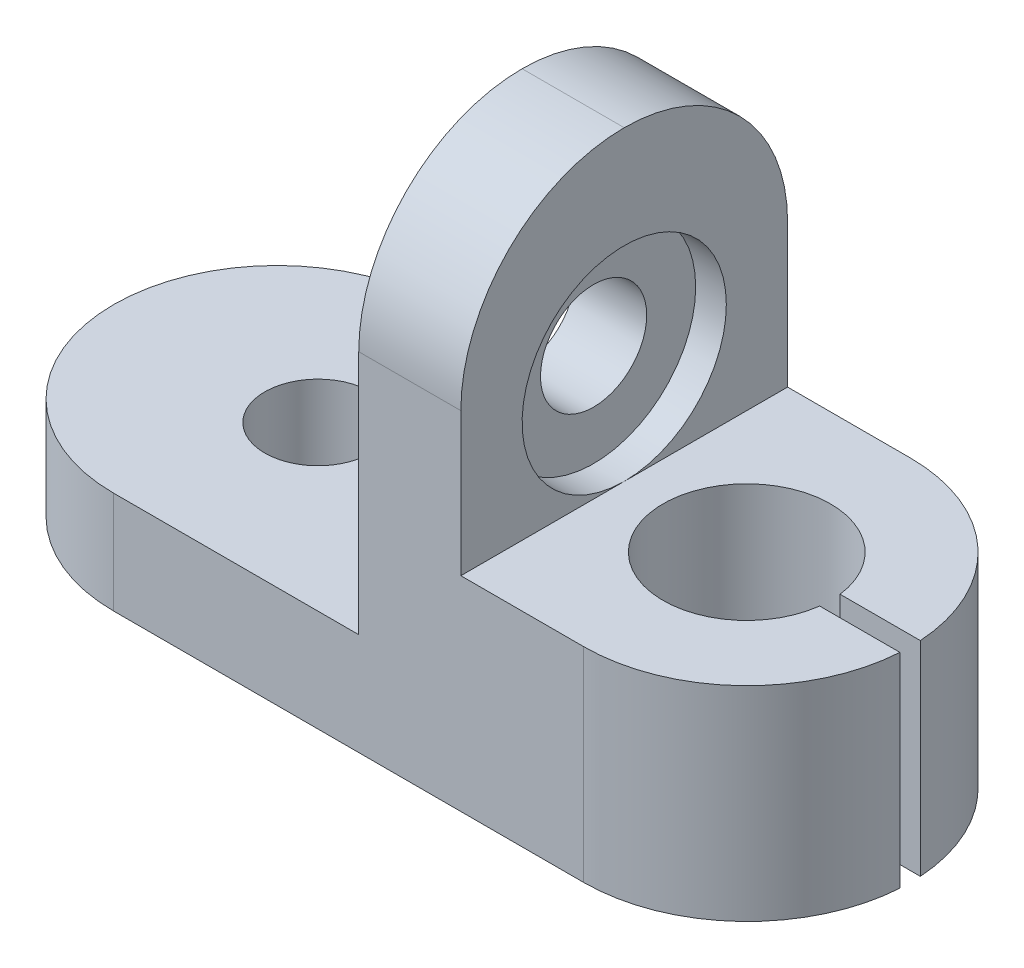
ISO-10303-21;
HEADER;
FILE_DESCRIPTION(('STEP AP214'),'2;1');
FILE_NAME('part.step','',(''),(''),'','','');
FILE_SCHEMA(('AUTOMOTIVE_DESIGN { 1 0 10303 214 1 1 1 1 }'));
ENDSEC;
DATA;
#1=APPLICATION_CONTEXT('core data for automotive mechanical design processes');
#2=APPLICATION_PROTOCOL_DEFINITION('international standard','automotive_design',2000,#1);
#3=PRODUCT_CONTEXT('',#1,'mechanical');
#4=PRODUCT('Part','Part','',(#3));
#5=PRODUCT_RELATED_PRODUCT_CATEGORY('part','',(#4));
#6=PRODUCT_DEFINITION_FORMATION('','',#4);
#7=PRODUCT_DEFINITION_CONTEXT('part definition',#1,'design');
#8=PRODUCT_DEFINITION('design','',#6,#7);
#9=PRODUCT_DEFINITION_SHAPE('','',#8);
#10=(LENGTH_UNIT() NAMED_UNIT(*) SI_UNIT(.MILLI.,.METRE.));
#11=(NAMED_UNIT(*) PLANE_ANGLE_UNIT() SI_UNIT($,.RADIAN.));
#12=(NAMED_UNIT(*) SI_UNIT($,.STERADIAN.) SOLID_ANGLE_UNIT());
#13=UNCERTAINTY_MEASURE_WITH_UNIT(LENGTH_MEASURE(1.E-05),#10,'distance_accuracy_value','');
#14=(GEOMETRIC_REPRESENTATION_CONTEXT(3) GLOBAL_UNCERTAINTY_ASSIGNED_CONTEXT((#13)) GLOBAL_UNIT_ASSIGNED_CONTEXT((#10,
#11,#12)) REPRESENTATION_CONTEXT('',''));
#15=CARTESIAN_POINT('',(0.,0.,0.));
#16=DIRECTION('',(0.,0.,1.));
#17=DIRECTION('',(1.,0.,0.));
#18=AXIS2_PLACEMENT_3D('',#15,#16,#17);
#19=CARTESIAN_POINT('',(20.,15.,0.));
#20=DIRECTION('',(-1.,0.,0.));
#21=DIRECTION('',(0.,0.,1.));
#22=AXIS2_PLACEMENT_3D('',#19,#20,#21);
#23=CYLINDRICAL_SURFACE('',#22,2.6);
#24=CARTESIAN_POINT('',(-5.,15.,0.));
#25=DIRECTION('',(-1.,0.,0.));
#26=DIRECTION('',(0.,0.,1.));
#27=AXIS2_PLACEMENT_3D('',#24,#25,#26);
#28=CIRCLE('',#27,2.6);
#29=CARTESIAN_POINT('',(-5.,15.,2.6));
#30=VERTEX_POINT('',#29);
#31=EDGE_CURVE('E308',#30,#30,#28,.T.);
#32=ORIENTED_EDGE('',*,*,#31,.T.);
#33=EDGE_LOOP('',(#32));
#34=FACE_BOUND('',#33,.T.);
#35=CARTESIAN_POINT('',(-1.5,15.,0.));
#36=DIRECTION('',(1.,0.,0.));
#37=DIRECTION('',(0.,0.,-1.));
#38=AXIS2_PLACEMENT_3D('',#35,#36,#37);
#39=CIRCLE('',#38,2.6);
#40=CARTESIAN_POINT('',(-1.5,15.,-2.6));
#41=VERTEX_POINT('',#40);
#42=EDGE_CURVE('E40',#41,#41,#39,.F.);
#43=ORIENTED_EDGE('',*,*,#42,.F.);
#44=EDGE_LOOP('',(#43));
#45=FACE_BOUND('',#44,.T.);
#46=ADVANCED_FACE('F36',(#34,#45),#23,.F.);
#47=CARTESIAN_POINT('',(0.,5.,0.));
#48=DIRECTION('',(0.,1.,0.));
#49=DIRECTION('',(0.,0.,1.));
#50=AXIS2_PLACEMENT_3D('',#47,#48,#49);
#51=PLANE('',#50);
#52=CARTESIAN_POINT('',(-15.,5.,0.));
#53=DIRECTION('',(0.,1.,0.));
#54=DIRECTION('',(0.,0.,1.));
#55=AXIS2_PLACEMENT_3D('',#52,#53,#54);
#56=CIRCLE('',#55,2.6);
#57=CARTESIAN_POINT('',(-15.,5.,2.6));
#58=VERTEX_POINT('',#57);
#59=EDGE_CURVE('E177',#58,#58,#56,.T.);
#60=ORIENTED_EDGE('',*,*,#59,.F.);
#61=EDGE_LOOP('',(#60));
#62=FACE_BOUND('',#61,.T.);
#63=DIRECTION('',(1.,0.,0.));
#64=VECTOR('',#63,1.);
#65=CARTESIAN_POINT('',(0.,5.,-8.));
#66=LINE('',#65,#64);
#67=CARTESIAN_POINT('',(-17.,5.,-8.));
#68=VERTEX_POINT('',#67);
#69=CARTESIAN_POINT('',(-5.,5.,-8.));
#70=VERTEX_POINT('',#69);
#71=EDGE_CURVE('E184',#68,#70,#66,.T.);
#72=ORIENTED_EDGE('',*,*,#71,.F.);
#73=CARTESIAN_POINT('',(-17.,5.,0.));
#74=DIRECTION('',(0.,1.,0.));
#75=DIRECTION('',(0.,0.,1.));
#76=AXIS2_PLACEMENT_3D('',#73,#74,#75);
#77=CIRCLE('',#76,8.);
#78=CARTESIAN_POINT('',(-25.,5.,0.));
#79=VERTEX_POINT('',#78);
#80=EDGE_CURVE('E238',#68,#79,#77,.T.);
#81=ORIENTED_EDGE('',*,*,#80,.T.);
#82=CARTESIAN_POINT('',(-17.,5.,0.));
#83=DIRECTION('',(0.,1.,0.));
#84=DIRECTION('',(0.,0.,1.));
#85=AXIS2_PLACEMENT_3D('',#82,#83,#84);
#86=CIRCLE('',#85,8.);
#87=CARTESIAN_POINT('',(-17.,5.,8.));
#88=VERTEX_POINT('',#87);
#89=EDGE_CURVE('E232',#79,#88,#86,.T.);
#90=ORIENTED_EDGE('',*,*,#89,.T.);
#91=DIRECTION('',(1.,0.,0.));
#92=VECTOR('',#91,1.);
#93=CARTESIAN_POINT('',(0.,5.,8.));
#94=LINE('',#93,#92);
#95=CARTESIAN_POINT('',(-5.,5.,8.));
#96=VERTEX_POINT('',#95);
#97=EDGE_CURVE('E180',#88,#96,#94,.T.);
#98=ORIENTED_EDGE('',*,*,#97,.T.);
#99=DIRECTION('',(0.,0.,-1.));
#100=VECTOR('',#99,1.);
#101=CARTESIAN_POINT('',(-5.,5.,0.));
#102=LINE('',#101,#100);
#103=EDGE_CURVE('E149',#96,#70,#102,.T.);
#104=ORIENTED_EDGE('',*,*,#103,.T.);
#105=EDGE_LOOP('',(#72,#81,#90,#98,#104));
#106=FACE_BOUND('',#105,.T.);
#107=ADVANCED_FACE('F291',(#62,#106),#51,.T.);
#108=CARTESIAN_POINT('',(0.,5.,8.));
#109=DIRECTION('',(0.,0.,-1.));
#110=DIRECTION('',(-1.,0.,0.));
#111=AXIS2_PLACEMENT_3D('',#108,#109,#110);
#112=PLANE('',#111);
#113=DIRECTION('',(0.,-1.,0.));
#114=VECTOR('',#113,1.);
#115=CARTESIAN_POINT('',(0.,25.,8.));
#116=LINE('',#115,#114);
#117=CARTESIAN_POINT('',(0.,17.,8.));
#118=VERTEX_POINT('',#117);
#119=CARTESIAN_POINT('',(0.,10.,8.));
#120=VERTEX_POINT('',#119);
#121=EDGE_CURVE('E266',#118,#120,#116,.T.);
#122=ORIENTED_EDGE('',*,*,#121,.F.);
#123=DIRECTION('',(1.,0.,0.));
#124=VECTOR('',#123,1.);
#125=CARTESIAN_POINT('',(-5.,17.,8.));
#126=LINE('',#125,#124);
#127=CARTESIAN_POINT('',(-5.,17.,8.));
#128=VERTEX_POINT('',#127);
#129=EDGE_CURVE('E244',#118,#128,#126,.F.);
#130=ORIENTED_EDGE('',*,*,#129,.T.);
#131=DIRECTION('',(0.,-1.,0.));
#132=VECTOR('',#131,1.);
#133=CARTESIAN_POINT('',(-5.,25.,8.));
#134=LINE('',#133,#132);
#135=EDGE_CURVE('E264',#128,#96,#134,.T.);
#136=ORIENTED_EDGE('',*,*,#135,.T.);
#137=ORIENTED_EDGE('',*,*,#97,.F.);
#138=DIRECTION('',(0.,-1.,0.));
#139=VECTOR('',#138,1.);
#140=CARTESIAN_POINT('',(-17.,5.,8.));
#141=LINE('',#140,#139);
#142=CARTESIAN_POINT('',(-17.,0.,8.));
#143=VERTEX_POINT('',#142);
#144=EDGE_CURVE('E223',#88,#143,#141,.T.);
#145=ORIENTED_EDGE('',*,*,#144,.T.);
#146=DIRECTION('',(1.,0.,0.));
#147=VECTOR('',#146,1.);
#148=CARTESIAN_POINT('',(0.,0.,8.));
#149=LINE('',#148,#147);
#150=CARTESIAN_POINT('',(6.01564028866434,0.,8.));
#151=VERTEX_POINT('',#150);
#152=EDGE_CURVE('E190',#143,#151,#149,.T.);
#153=ORIENTED_EDGE('',*,*,#152,.T.);
#154=DIRECTION('',(0.,-1.,0.));
#155=VECTOR('',#154,1.);
#156=CARTESIAN_POINT('',(6.01564028866434,5.,8.));
#157=LINE('',#156,#155);
#158=CARTESIAN_POINT('',(6.01564028866434,10.,8.));
#159=VERTEX_POINT('',#158);
#160=EDGE_CURVE('E214',#151,#159,#157,.F.);
#161=ORIENTED_EDGE('',*,*,#160,.T.);
#162=DIRECTION('',(1.,0.,0.));
#163=VECTOR('',#162,1.);
#164=CARTESIAN_POINT('',(0.,10.,8.));
#165=LINE('',#164,#163);
#166=EDGE_CURVE('E157',#120,#159,#165,.T.);
#167=ORIENTED_EDGE('',*,*,#166,.F.);
#168=EDGE_LOOP('',(#122,#130,#136,#137,#145,#153,#161,#167));
#169=FACE_BOUND('',#168,.T.);
#170=ADVANCED_FACE('F298',(#169),#112,.F.);
#171=CARTESIAN_POINT('',(0.,5.,0.500000000000011));
#172=DIRECTION('',(0.,0.,1.));
#173=DIRECTION('',(1.,0.,0.));
#174=AXIS2_PLACEMENT_3D('',#171,#172,#173);
#175=PLANE('',#174);
#176=DIRECTION('',(-1.,0.,0.));
#177=VECTOR('',#176,1.);
#178=CARTESIAN_POINT('',(0.,0.,0.500000000000011));
#179=LINE('',#178,#177);
#180=CARTESIAN_POINT('',(14.,0.,0.500000000000033));
#181=VERTEX_POINT('',#180);
#182=CARTESIAN_POINT('',(10.0693979898752,0.,0.50000000000003));
#183=VERTEX_POINT('',#182);
#184=EDGE_CURVE('E192',#181,#183,#179,.T.);
#185=ORIENTED_EDGE('',*,*,#184,.T.);
#186=DIRECTION('',(0.,-1.,0.));
#187=VECTOR('',#186,1.);
#188=CARTESIAN_POINT('',(10.0693979898752,5.,0.50000000000003));
#189=LINE('',#188,#187);
#190=CARTESIAN_POINT('',(10.0693979898752,10.,0.50000000000003));
#191=VERTEX_POINT('',#190);
#192=EDGE_CURVE('E206',#191,#183,#189,.T.);
#193=ORIENTED_EDGE('',*,*,#192,.F.);
#194=DIRECTION('',(-1.,0.,0.));
#195=VECTOR('',#194,1.);
#196=CARTESIAN_POINT('',(0.,10.,0.500000000000011));
#197=LINE('',#196,#195);
#198=CARTESIAN_POINT('',(14.,10.,0.500000000000033));
#199=VERTEX_POINT('',#198);
#200=EDGE_CURVE('E173',#199,#191,#197,.T.);
#201=ORIENTED_EDGE('',*,*,#200,.F.);
#202=DIRECTION('',(0.,-1.,0.));
#203=VECTOR('',#202,1.);
#204=CARTESIAN_POINT('',(14.,5.,0.500000000000033));
#205=LINE('',#204,#203);
#206=EDGE_CURVE('E208',#199,#181,#205,.T.);
#207=ORIENTED_EDGE('',*,*,#206,.T.);
#208=EDGE_LOOP('',(#185,#193,#201,#207));
#209=FACE_BOUND('',#208,.T.);
#210=ADVANCED_FACE('F350',(#209),#175,.F.);
#211=CARTESIAN_POINT('',(6.,5.,0.));
#212=DIRECTION('',(0.,-1.,0.));
#213=DIRECTION('',(0.,0.,-1.));
#214=AXIS2_PLACEMENT_3D('',#211,#212,#213);
#215=CYLINDRICAL_SURFACE('',#214,4.1);
#216=CARTESIAN_POINT('',(6.,0.,0.));
#217=DIRECTION('',(0.,1.,0.));
#218=DIRECTION('',(0.,0.,1.));
#219=AXIS2_PLACEMENT_3D('',#216,#217,#218);
#220=CIRCLE('',#219,4.1);
#221=CARTESIAN_POINT('',(10.0693979898752,0.,-0.49999999999997));
#222=VERTEX_POINT('',#221);
#223=EDGE_CURVE('E195',#222,#183,#220,.T.);
#224=ORIENTED_EDGE('',*,*,#223,.F.);
#225=DIRECTION('',(0.,-1.,0.));
#226=VECTOR('',#225,1.);
#227=CARTESIAN_POINT('',(10.0693979898752,5.,-0.49999999999997));
#228=LINE('',#227,#226);
#229=CARTESIAN_POINT('',(10.0693979898752,10.,-0.49999999999997));
#230=VERTEX_POINT('',#229);
#231=EDGE_CURVE('E204',#230,#222,#228,.T.);
#232=ORIENTED_EDGE('',*,*,#231,.F.);
#233=CARTESIAN_POINT('',(6.,10.,0.));
#234=DIRECTION('',(0.,1.,0.));
#235=DIRECTION('',(0.,0.,1.));
#236=AXIS2_PLACEMENT_3D('',#233,#234,#235);
#237=CIRCLE('',#236,4.1);
#238=EDGE_CURVE('E167',#230,#191,#237,.T.);
#239=ORIENTED_EDGE('',*,*,#238,.T.);
#240=ORIENTED_EDGE('',*,*,#192,.T.);
#241=EDGE_LOOP('',(#224,#232,#239,#240));
#242=FACE_BOUND('',#241,.T.);
#243=ADVANCED_FACE('F274',(#242),#215,.F.);
#244=CARTESIAN_POINT('',(0.,5.,-0.499999999999989));
#245=DIRECTION('',(0.,0.,1.));
#246=DIRECTION('',(1.,0.,0.));
#247=AXIS2_PLACEMENT_3D('',#244,#245,#246);
#248=PLANE('',#247);
#249=DIRECTION('',(-1.,0.,0.));
#250=VECTOR('',#249,1.);
#251=CARTESIAN_POINT('',(0.,0.,-0.499999999999989));
#252=LINE('',#251,#250);
#253=CARTESIAN_POINT('',(14.,0.,-0.499999999999963));
#254=VERTEX_POINT('',#253);
#255=EDGE_CURVE('E198',#254,#222,#252,.T.);
#256=ORIENTED_EDGE('',*,*,#255,.F.);
#257=DIRECTION('',(0.,-1.,0.));
#258=VECTOR('',#257,1.);
#259=CARTESIAN_POINT('',(14.,5.,-0.499999999999963));
#260=LINE('',#259,#258);
#261=CARTESIAN_POINT('',(14.,10.,-0.499999999999963));
#262=VERTEX_POINT('',#261);
#263=EDGE_CURVE('E187',#262,#254,#260,.T.);
#264=ORIENTED_EDGE('',*,*,#263,.F.);
#265=DIRECTION('',(-1.,0.,0.));
#266=VECTOR('',#265,1.);
#267=CARTESIAN_POINT('',(0.,10.,-0.499999999999989));
#268=LINE('',#267,#266);
#269=EDGE_CURVE('E164',#262,#230,#268,.T.);
#270=ORIENTED_EDGE('',*,*,#269,.T.);
#271=ORIENTED_EDGE('',*,*,#231,.T.);
#272=EDGE_LOOP('',(#256,#264,#270,#271));
#273=FACE_BOUND('',#272,.T.);
#274=ADVANCED_FACE('F278',(#273),#248,.T.);
#275=CARTESIAN_POINT('',(0.,5.,-8.));
#276=DIRECTION('',(0.,0.,-1.));
#277=DIRECTION('',(-1.,0.,0.));
#278=AXIS2_PLACEMENT_3D('',#275,#276,#277);
#279=PLANE('',#278);
#280=DIRECTION('',(0.,-1.,0.));
#281=VECTOR('',#280,1.);
#282=CARTESIAN_POINT('',(-5.,25.,-8.));
#283=LINE('',#282,#281);
#284=CARTESIAN_POINT('',(-5.,17.,-8.));
#285=VERTEX_POINT('',#284);
#286=EDGE_CURVE('E150',#285,#70,#283,.T.);
#287=ORIENTED_EDGE('',*,*,#286,.F.);
#288=DIRECTION('',(1.,0.,0.));
#289=VECTOR('',#288,1.);
#290=CARTESIAN_POINT('',(0.,17.,-8.));
#291=LINE('',#290,#289);
#292=CARTESIAN_POINT('',(0.,17.,-8.));
#293=VERTEX_POINT('',#292);
#294=EDGE_CURVE('E147',#285,#293,#291,.T.);
#295=ORIENTED_EDGE('',*,*,#294,.T.);
#296=DIRECTION('',(0.,-1.,0.));
#297=VECTOR('',#296,1.);
#298=CARTESIAN_POINT('',(0.,25.,-8.));
#299=LINE('',#298,#297);
#300=CARTESIAN_POINT('',(0.,10.,-8.));
#301=VERTEX_POINT('',#300);
#302=EDGE_CURVE('E139',#293,#301,#299,.T.);
#303=ORIENTED_EDGE('',*,*,#302,.T.);
#304=DIRECTION('',(1.,0.,0.));
#305=VECTOR('',#304,1.);
#306=CARTESIAN_POINT('',(0.,10.,-8.));
#307=LINE('',#306,#305);
#308=CARTESIAN_POINT('',(6.01564028866434,10.,-8.));
#309=VERTEX_POINT('',#308);
#310=EDGE_CURVE('E145',#301,#309,#307,.T.);
#311=ORIENTED_EDGE('',*,*,#310,.T.);
#312=DIRECTION('',(0.,1.,0.));
#313=VECTOR('',#312,1.);
#314=CARTESIAN_POINT('',(6.01564028866434,0.,-8.));
#315=LINE('',#314,#313);
#316=CARTESIAN_POINT('',(6.01564028866434,0.,-8.));
#317=VERTEX_POINT('',#316);
#318=EDGE_CURVE('E218',#309,#317,#315,.F.);
#319=ORIENTED_EDGE('',*,*,#318,.T.);
#320=DIRECTION('',(1.,0.,0.));
#321=VECTOR('',#320,1.);
#322=CARTESIAN_POINT('',(0.,0.,-8.));
#323=LINE('',#322,#321);
#324=CARTESIAN_POINT('',(-17.,0.,-8.));
#325=VERTEX_POINT('',#324);
#326=EDGE_CURVE('E181',#325,#317,#323,.T.);
#327=ORIENTED_EDGE('',*,*,#326,.F.);
#328=DIRECTION('',(0.,-1.,0.));
#329=VECTOR('',#328,1.);
#330=CARTESIAN_POINT('',(-17.,5.,-8.));
#331=LINE('',#330,#329);
#332=EDGE_CURVE('E236',#325,#68,#331,.F.);
#333=ORIENTED_EDGE('',*,*,#332,.T.);
#334=ORIENTED_EDGE('',*,*,#71,.T.);
#335=EDGE_LOOP('',(#287,#295,#303,#311,#319,#327,#333,#334));
#336=FACE_BOUND('',#335,.T.);
#337=ADVANCED_FACE('F142',(#336),#279,.T.);
#338=CARTESIAN_POINT('',(-15.,5.,0.));
#339=DIRECTION('',(0.,-1.,0.));
#340=DIRECTION('',(0.,0.,-1.));
#341=AXIS2_PLACEMENT_3D('',#338,#339,#340);
#342=CYLINDRICAL_SURFACE('',#341,2.6);
#343=ORIENTED_EDGE('',*,*,#59,.T.);
#344=EDGE_LOOP('',(#343));
#345=FACE_BOUND('',#344,.T.);
#346=CARTESIAN_POINT('',(-15.,0.,0.));
#347=DIRECTION('',(0.,1.,0.));
#348=DIRECTION('',(0.,0.,1.));
#349=AXIS2_PLACEMENT_3D('',#346,#347,#348);
#350=CIRCLE('',#349,2.6);
#351=CARTESIAN_POINT('',(-15.,0.,2.6));
#352=VERTEX_POINT('',#351);
#353=EDGE_CURVE('E176',#352,#352,#350,.T.);
#354=ORIENTED_EDGE('',*,*,#353,.F.);
#355=EDGE_LOOP('',(#354));
#356=FACE_BOUND('',#355,.T.);
#357=ADVANCED_FACE('F343',(#345,#356),#342,.F.);
#358=CARTESIAN_POINT('',(0.,0.,0.));
#359=DIRECTION('',(0.,1.,0.));
#360=DIRECTION('',(0.,0.,1.));
#361=AXIS2_PLACEMENT_3D('',#358,#359,#360);
#362=PLANE('',#361);
#363=CARTESIAN_POINT('',(-17.,0.,0.));
#364=DIRECTION('',(0.,1.,0.));
#365=DIRECTION('',(0.,0.,1.));
#366=AXIS2_PLACEMENT_3D('',#363,#364,#365);
#367=CIRCLE('',#366,8.);
#368=CARTESIAN_POINT('',(-25.,0.,0.));
#369=VERTEX_POINT('',#368);
#370=EDGE_CURVE('E226',#143,#369,#367,.F.);
#371=ORIENTED_EDGE('',*,*,#370,.T.);
#372=CARTESIAN_POINT('',(-17.,0.,0.));
#373=DIRECTION('',(0.,1.,0.));
#374=DIRECTION('',(0.,0.,1.));
#375=AXIS2_PLACEMENT_3D('',#372,#373,#374);
#376=CIRCLE('',#375,8.);
#377=EDGE_CURVE('E234',#369,#325,#376,.F.);
#378=ORIENTED_EDGE('',*,*,#377,.T.);
#379=ORIENTED_EDGE('',*,*,#326,.T.);
#380=CARTESIAN_POINT('',(6.01564028866434,0.,0.));
#381=DIRECTION('',(0.,1.,0.));
#382=DIRECTION('',(0.,0.,1.));
#383=AXIS2_PLACEMENT_3D('',#380,#381,#382);
#384=CIRCLE('',#383,8.);
#385=EDGE_CURVE('E220',#317,#254,#384,.F.);
#386=ORIENTED_EDGE('',*,*,#385,.T.);
#387=ORIENTED_EDGE('',*,*,#255,.T.);
#388=ORIENTED_EDGE('',*,*,#223,.T.);
#389=ORIENTED_EDGE('',*,*,#184,.F.);
#390=CARTESIAN_POINT('',(6.01564028866434,0.,0.));
#391=DIRECTION('',(0.,1.,0.));
#392=DIRECTION('',(0.,0.,1.));
#393=AXIS2_PLACEMENT_3D('',#390,#391,#392);
#394=CIRCLE('',#393,8.);
#395=EDGE_CURVE('E211',#181,#151,#394,.F.);
#396=ORIENTED_EDGE('',*,*,#395,.T.);
#397=ORIENTED_EDGE('',*,*,#152,.F.);
#398=EDGE_LOOP('',(#371,#378,#379,#386,#387,#388,#389,#396,#397));
#399=FACE_BOUND('',#398,.T.);
#400=ORIENTED_EDGE('',*,*,#353,.T.);
#401=EDGE_LOOP('',(#400));
#402=FACE_BOUND('',#401,.T.);
#403=ADVANCED_FACE('F299',(#399,#402),#362,.F.);
#404=CARTESIAN_POINT('',(0.,10.,0.));
#405=DIRECTION('',(0.,1.,0.));
#406=DIRECTION('',(0.,0.,1.));
#407=AXIS2_PLACEMENT_3D('',#404,#405,#406);
#408=PLANE('',#407);
#409=ORIENTED_EDGE('',*,*,#269,.F.);
#410=CARTESIAN_POINT('',(6.01564028866434,10.,0.));
#411=DIRECTION('',(0.,1.,0.));
#412=DIRECTION('',(0.,0.,1.));
#413=AXIS2_PLACEMENT_3D('',#410,#411,#412);
#414=CIRCLE('',#413,8.);
#415=EDGE_CURVE('E163',#262,#309,#414,.T.);
#416=ORIENTED_EDGE('',*,*,#415,.T.);
#417=ORIENTED_EDGE('',*,*,#310,.F.);
#418=DIRECTION('',(0.,0.,1.));
#419=VECTOR('',#418,1.);
#420=CARTESIAN_POINT('',(0.,10.,0.));
#421=LINE('',#420,#419);
#422=CARTESIAN_POINT('',(0.,10.,0.));
#423=VERTEX_POINT('',#422);
#424=EDGE_CURVE('E153',#301,#423,#421,.T.);
#425=ORIENTED_EDGE('',*,*,#424,.T.);
#426=EDGE_CURVE('E158',#423,#120,#421,.T.);
#427=ORIENTED_EDGE('',*,*,#426,.T.);
#428=ORIENTED_EDGE('',*,*,#166,.T.);
#429=CARTESIAN_POINT('',(6.01564028866434,10.,0.));
#430=DIRECTION('',(0.,1.,0.));
#431=DIRECTION('',(0.,0.,1.));
#432=AXIS2_PLACEMENT_3D('',#429,#430,#431);
#433=CIRCLE('',#432,8.);
#434=EDGE_CURVE('E216',#159,#199,#433,.T.);
#435=ORIENTED_EDGE('',*,*,#434,.T.);
#436=ORIENTED_EDGE('',*,*,#200,.T.);
#437=ORIENTED_EDGE('',*,*,#238,.F.);
#438=EDGE_LOOP('',(#409,#416,#417,#425,#427,#428,#435,#436,#437));
#439=FACE_BOUND('',#438,.T.);
#440=ADVANCED_FACE('F161',(#439),#408,.T.);
#441=CARTESIAN_POINT('',(0.,25.,0.));
#442=DIRECTION('',(1.,0.,0.));
#443=DIRECTION('',(0.,0.,-1.));
#444=AXIS2_PLACEMENT_3D('',#441,#442,#443);
#445=PLANE('',#444);
#446=ORIENTED_EDGE('',*,*,#426,.F.);
#447=CARTESIAN_POINT('',(0.,15.,0.));
#448=DIRECTION('',(1.,0.,0.));
#449=DIRECTION('',(0.,0.,-1.));
#450=AXIS2_PLACEMENT_3D('',#447,#448,#449);
#451=CIRCLE('',#450,5.);
#452=EDGE_CURVE('E50',#423,#423,#451,.T.);
#453=ORIENTED_EDGE('',*,*,#452,.F.);
#454=ORIENTED_EDGE('',*,*,#424,.F.);
#455=ORIENTED_EDGE('',*,*,#302,.F.);
#456=CARTESIAN_POINT('',(0.,17.,0.));
#457=DIRECTION('',(1.,0.,0.));
#458=DIRECTION('',(0.,0.,-1.));
#459=AXIS2_PLACEMENT_3D('',#456,#457,#458);
#460=CIRCLE('',#459,8.);
#461=CARTESIAN_POINT('',(0.,25.,0.));
#462=VERTEX_POINT('',#461);
#463=EDGE_CURVE('E45',#293,#462,#460,.T.);
#464=ORIENTED_EDGE('',*,*,#463,.T.);
#465=CARTESIAN_POINT('',(0.,17.,0.));
#466=DIRECTION('',(1.,0.,0.));
#467=DIRECTION('',(0.,0.,-1.));
#468=AXIS2_PLACEMENT_3D('',#465,#466,#467);
#469=CIRCLE('',#468,8.);
#470=EDGE_CURVE('E242',#462,#118,#469,.T.);
#471=ORIENTED_EDGE('',*,*,#470,.T.);
#472=ORIENTED_EDGE('',*,*,#121,.T.);
#473=EDGE_LOOP('',(#446,#453,#454,#455,#464,#471,#472));
#474=FACE_BOUND('',#473,.T.);
#475=ADVANCED_FACE('F155',(#474),#445,.T.);
#476=CARTESIAN_POINT('',(-5.,25.,0.));
#477=DIRECTION('',(1.,0.,0.));
#478=DIRECTION('',(0.,0.,-1.));
#479=AXIS2_PLACEMENT_3D('',#476,#477,#478);
#480=PLANE('',#479);
#481=ORIENTED_EDGE('',*,*,#31,.F.);
#482=EDGE_LOOP('',(#481));
#483=FACE_BOUND('',#482,.T.);
#484=CARTESIAN_POINT('',(-5.,17.,0.));
#485=DIRECTION('',(1.,0.,0.));
#486=DIRECTION('',(0.,0.,-1.));
#487=AXIS2_PLACEMENT_3D('',#484,#485,#486);
#488=CIRCLE('',#487,8.);
#489=CARTESIAN_POINT('',(-5.,25.,0.));
#490=VERTEX_POINT('',#489);
#491=EDGE_CURVE('E246',#128,#490,#488,.F.);
#492=ORIENTED_EDGE('',*,*,#491,.T.);
#493=CARTESIAN_POINT('',(-5.,17.,0.));
#494=DIRECTION('',(1.,0.,0.));
#495=DIRECTION('',(0.,0.,-1.));
#496=AXIS2_PLACEMENT_3D('',#493,#494,#495);
#497=CIRCLE('',#496,8.);
#498=EDGE_CURVE('E11',#490,#285,#497,.F.);
#499=ORIENTED_EDGE('',*,*,#498,.T.);
#500=ORIENTED_EDGE('',*,*,#286,.T.);
#501=ORIENTED_EDGE('',*,*,#103,.F.);
#502=ORIENTED_EDGE('',*,*,#135,.F.);
#503=EDGE_LOOP('',(#492,#499,#500,#501,#502));
#504=FACE_BOUND('',#503,.T.);
#505=ADVANCED_FACE('F259',(#483,#504),#480,.F.);
#506=CARTESIAN_POINT('',(6.01564028866434,5.,0.));
#507=DIRECTION('',(0.,-1.,0.));
#508=DIRECTION('',(0.,0.,-1.));
#509=AXIS2_PLACEMENT_3D('',#506,#507,#508);
#510=CYLINDRICAL_SURFACE('',#509,8.);
#511=ORIENTED_EDGE('',*,*,#434,.F.);
#512=ORIENTED_EDGE('',*,*,#160,.F.);
#513=ORIENTED_EDGE('',*,*,#395,.F.);
#514=ORIENTED_EDGE('',*,*,#206,.F.);
#515=EDGE_LOOP('',(#511,#512,#513,#514));
#516=FACE_BOUND('',#515,.T.);
#517=ADVANCED_FACE('F306',(#516),#510,.T.);
#518=CARTESIAN_POINT('',(6.01564028866434,5.,0.));
#519=DIRECTION('',(0.,-1.,0.));
#520=DIRECTION('',(0.,0.,-1.));
#521=AXIS2_PLACEMENT_3D('',#518,#519,#520);
#522=CYLINDRICAL_SURFACE('',#521,8.);
#523=ORIENTED_EDGE('',*,*,#415,.F.);
#524=ORIENTED_EDGE('',*,*,#263,.T.);
#525=ORIENTED_EDGE('',*,*,#385,.F.);
#526=ORIENTED_EDGE('',*,*,#318,.F.);
#527=EDGE_LOOP('',(#523,#524,#525,#526));
#528=FACE_BOUND('',#527,.T.);
#529=ADVANCED_FACE('F281',(#528),#522,.T.);
#530=CARTESIAN_POINT('',(-17.,5.,0.));
#531=DIRECTION('',(0.,-1.,0.));
#532=DIRECTION('',(0.,0.,-1.));
#533=AXIS2_PLACEMENT_3D('',#530,#531,#532);
#534=CYLINDRICAL_SURFACE('',#533,8.);
#535=ORIENTED_EDGE('',*,*,#89,.F.);
#536=DIRECTION('',(0.,-1.,0.));
#537=VECTOR('',#536,1.);
#538=CARTESIAN_POINT('',(-25.,5.,0.));
#539=LINE('',#538,#537);
#540=EDGE_CURVE('E229',#369,#79,#539,.F.);
#541=ORIENTED_EDGE('',*,*,#540,.F.);
#542=ORIENTED_EDGE('',*,*,#370,.F.);
#543=ORIENTED_EDGE('',*,*,#144,.F.);
#544=EDGE_LOOP('',(#535,#541,#542,#543));
#545=FACE_BOUND('',#544,.T.);
#546=ADVANCED_FACE('F295',(#545),#534,.T.);
#547=CARTESIAN_POINT('',(-17.,5.,0.));
#548=DIRECTION('',(0.,1.,0.));
#549=DIRECTION('',(0.,0.,1.));
#550=AXIS2_PLACEMENT_3D('',#547,#548,#549);
#551=CYLINDRICAL_SURFACE('',#550,8.);
#552=ORIENTED_EDGE('',*,*,#80,.F.);
#553=ORIENTED_EDGE('',*,*,#332,.F.);
#554=ORIENTED_EDGE('',*,*,#377,.F.);
#555=ORIENTED_EDGE('',*,*,#540,.T.);
#556=EDGE_LOOP('',(#552,#553,#554,#555));
#557=FACE_BOUND('',#556,.T.);
#558=ADVANCED_FACE('F287',(#557),#551,.T.);
#559=CARTESIAN_POINT('',(0.,17.,0.));
#560=DIRECTION('',(-1.,0.,0.));
#561=DIRECTION('',(0.,0.,1.));
#562=AXIS2_PLACEMENT_3D('',#559,#560,#561);
#563=CYLINDRICAL_SURFACE('',#562,8.);
#564=ORIENTED_EDGE('',*,*,#491,.F.);
#565=ORIENTED_EDGE('',*,*,#129,.F.);
#566=ORIENTED_EDGE('',*,*,#470,.F.);
#567=DIRECTION('',(1.,0.,0.));
#568=VECTOR('',#567,1.);
#569=CARTESIAN_POINT('',(0.,25.,0.));
#570=LINE('',#569,#568);
#571=EDGE_CURVE('E240',#490,#462,#570,.T.);
#572=ORIENTED_EDGE('',*,*,#571,.F.);
#573=EDGE_LOOP('',(#564,#565,#566,#572));
#574=FACE_BOUND('',#573,.T.);
#575=ADVANCED_FACE('F256',(#574),#563,.T.);
#576=CARTESIAN_POINT('',(0.,17.,0.));
#577=DIRECTION('',(1.,0.,0.));
#578=DIRECTION('',(0.,0.,-1.));
#579=AXIS2_PLACEMENT_3D('',#576,#577,#578);
#580=CYLINDRICAL_SURFACE('',#579,8.);
#581=ORIENTED_EDGE('',*,*,#498,.F.);
#582=ORIENTED_EDGE('',*,*,#571,.T.);
#583=ORIENTED_EDGE('',*,*,#463,.F.);
#584=ORIENTED_EDGE('',*,*,#294,.F.);
#585=EDGE_LOOP('',(#581,#582,#583,#584));
#586=FACE_BOUND('',#585,.T.);
#587=ADVANCED_FACE('F38',(#586),#580,.T.);
#588=CARTESIAN_POINT('',(-1.5,15.,0.));
#589=DIRECTION('',(1.,0.,0.));
#590=DIRECTION('',(0.,0.,-1.));
#591=AXIS2_PLACEMENT_3D('',#588,#589,#590);
#592=PLANE('',#591);
#593=CARTESIAN_POINT('',(-1.5,15.,0.));
#594=DIRECTION('',(1.,0.,0.));
#595=DIRECTION('',(0.,0.,-1.));
#596=AXIS2_PLACEMENT_3D('',#593,#594,#595);
#597=CIRCLE('',#596,5.);
#598=CARTESIAN_POINT('',(-1.5,15.,-5.));
#599=VERTEX_POINT('',#598);
#600=EDGE_CURVE('E313',#599,#599,#597,.T.);
#601=ORIENTED_EDGE('',*,*,#600,.T.);
#602=EDGE_LOOP('',(#601));
#603=FACE_BOUND('',#602,.T.);
#604=ORIENTED_EDGE('',*,*,#42,.T.);
#605=EDGE_LOOP('',(#604));
#606=FACE_BOUND('',#605,.T.);
#607=ADVANCED_FACE('F320',(#603,#606),#592,.T.);
#608=CARTESIAN_POINT('',(-1.5,15.,0.));
#609=DIRECTION('',(1.,0.,0.));
#610=DIRECTION('',(0.,0.,-1.));
#611=AXIS2_PLACEMENT_3D('',#608,#609,#610);
#612=CYLINDRICAL_SURFACE('',#611,5.);
#613=ORIENTED_EDGE('',*,*,#600,.F.);
#614=EDGE_LOOP('',(#613));
#615=FACE_BOUND('',#614,.T.);
#616=ORIENTED_EDGE('',*,*,#452,.T.);
#617=EDGE_LOOP('',(#616));
#618=FACE_BOUND('',#617,.T.);
#619=ADVANCED_FACE('F332',(#615,#618),#612,.F.);
#620=CLOSED_SHELL('',(#46,#107,#170,#210,#243,#274,#337,#357,#403,#440,#475,#505,#517,#529,#546,
#558,#575,#587,#607,#619));
#621=MANIFOLD_SOLID_BREP('B2',#620);
#622=ADVANCED_BREP_SHAPE_REPRESENTATION('',(#18,#621),#14);
#623=SHAPE_DEFINITION_REPRESENTATION(#9,#622);
ENDSEC;
END-ISO-10303-21;
